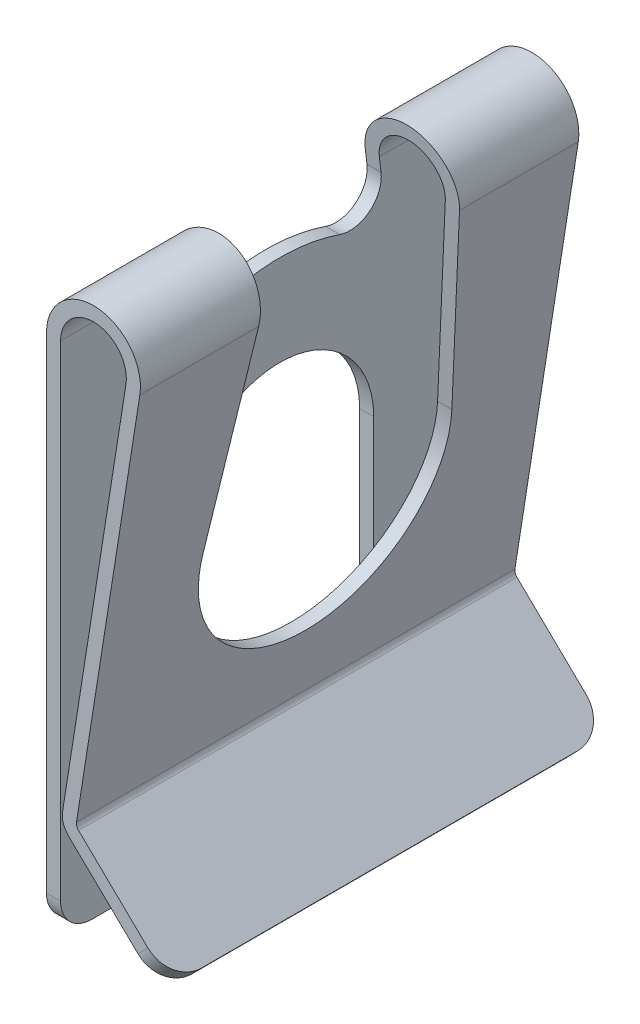
ISO-10303-21;
HEADER;
FILE_DESCRIPTION(('STEP AP214'),'2;1');
FILE_NAME('part.step','',(''),(''),'','','');
FILE_SCHEMA(('AUTOMOTIVE_DESIGN { 1 0 10303 214 1 1 1 1 }'));
ENDSEC;
DATA;
#1=APPLICATION_CONTEXT('core data for automotive mechanical design processes');
#2=APPLICATION_PROTOCOL_DEFINITION('international standard','automotive_design',2000,#1);
#3=PRODUCT_CONTEXT('',#1,'mechanical');
#4=PRODUCT('Part','Part','',(#3));
#5=PRODUCT_RELATED_PRODUCT_CATEGORY('part','',(#4));
#6=PRODUCT_DEFINITION_FORMATION('','',#4);
#7=PRODUCT_DEFINITION_CONTEXT('part definition',#1,'design');
#8=PRODUCT_DEFINITION('design','',#6,#7);
#9=PRODUCT_DEFINITION_SHAPE('','',#8);
#10=(LENGTH_UNIT() NAMED_UNIT(*) SI_UNIT(.MILLI.,.METRE.));
#11=(NAMED_UNIT(*) PLANE_ANGLE_UNIT() SI_UNIT($,.RADIAN.));
#12=(NAMED_UNIT(*) SI_UNIT($,.STERADIAN.) SOLID_ANGLE_UNIT());
#13=UNCERTAINTY_MEASURE_WITH_UNIT(LENGTH_MEASURE(1.E-05),#10,'distance_accuracy_value','');
#14=(GEOMETRIC_REPRESENTATION_CONTEXT(3) GLOBAL_UNCERTAINTY_ASSIGNED_CONTEXT((#13)) GLOBAL_UNIT_ASSIGNED_CONTEXT((#10,
#11,#12)) REPRESENTATION_CONTEXT('',''));
#15=CARTESIAN_POINT('',(0.,0.,0.));
#16=DIRECTION('',(0.,0.,1.));
#17=DIRECTION('',(1.,0.,0.));
#18=AXIS2_PLACEMENT_3D('',#15,#16,#17);
#19=CARTESIAN_POINT('',(0.711367038189841,-6.47841689545899,7.));
#20=DIRECTION('',(0.695317235453957,0.718702958168858,0.));
#21=DIRECTION('',(-0.718702958168858,0.695317235453957,0.));
#22=AXIS2_PLACEMENT_3D('',#19,#20,#21);
#23=PLANE('',#22);
#24=CARTESIAN_POINT('',(2.92425344639169,-8.61929866342166,5.99999999999992));
#25=DIRECTION('',(0.695317235453957,0.718702958168858,0.));
#26=DIRECTION('',(-0.718702958168858,0.695317235453957,0.));
#27=AXIS2_PLACEMENT_3D('',#24,#25,#26);
#28=CIRCLE('',#27,1.00000000000008);
#29=CARTESIAN_POINT('',(2.92425344639175,-8.61929866342172,7.));
#30=VERTEX_POINT('',#29);
#31=CARTESIAN_POINT('',(3.64295640456061,-9.31461589887568,6.));
#32=VERTEX_POINT('',#31);
#33=EDGE_CURVE('E405',#30,#32,#28,.T.);
#34=ORIENTED_EDGE('',*,*,#33,.F.);
#35=DIRECTION('',(0.718702958168858,-0.695317235453957,0.));
#36=VECTOR('',#35,1.);
#37=CARTESIAN_POINT('',(0.711367038189841,-6.47841689545899,7.));
#38=LINE('',#37,#36);
#39=CARTESIAN_POINT('',(0.711367038189841,-6.47841689545899,7.));
#40=VERTEX_POINT('',#39);
#41=EDGE_CURVE('E288',#40,#30,#38,.T.);
#42=ORIENTED_EDGE('',*,*,#41,.F.);
#43=DIRECTION('',(0.,0.,-1.));
#44=VECTOR('',#43,1.);
#45=CARTESIAN_POINT('',(0.711367038189841,-6.47841689545899,7.));
#46=LINE('',#45,#44);
#47=CARTESIAN_POINT('',(0.711367038189841,-6.47841689545899,-7.));
#48=VERTEX_POINT('',#47);
#49=EDGE_CURVE('E305',#40,#48,#46,.T.);
#50=ORIENTED_EDGE('',*,*,#49,.T.);
#51=DIRECTION('',(0.718702958168858,-0.695317235453957,0.));
#52=VECTOR('',#51,1.);
#53=CARTESIAN_POINT('',(0.711367038189841,-6.47841689545899,-7.));
#54=LINE('',#53,#52);
#55=CARTESIAN_POINT('',(2.92425344639175,-8.61929866342172,-7.));
#56=VERTEX_POINT('',#55);
#57=EDGE_CURVE('E264',#48,#56,#54,.T.);
#58=ORIENTED_EDGE('',*,*,#57,.T.);
#59=CARTESIAN_POINT('',(2.92425344639175,-8.61929866342172,-6.));
#60=DIRECTION('',(0.695317235453957,0.718702958168858,0.));
#61=DIRECTION('',(-0.718702958168858,0.695317235453957,0.));
#62=AXIS2_PLACEMENT_3D('',#59,#60,#61);
#63=CIRCLE('',#62,0.999999999999999);
#64=CARTESIAN_POINT('',(3.64295640456061,-9.31461589887568,-6.));
#65=VERTEX_POINT('',#64);
#66=EDGE_CURVE('E48',#65,#56,#63,.T.);
#67=ORIENTED_EDGE('',*,*,#66,.F.);
#68=DIRECTION('',(0.,0.,-1.));
#69=VECTOR('',#68,1.);
#70=CARTESIAN_POINT('',(3.64295640456061,-9.31461589887568,7.));
#71=LINE('',#70,#69);
#72=EDGE_CURVE('E406',#32,#65,#71,.T.);
#73=ORIENTED_EDGE('',*,*,#72,.F.);
#74=EDGE_LOOP('',(#34,#42,#50,#58,#67,#73));
#75=FACE_BOUND('',#74,.T.);
#76=ADVANCED_FACE('F33',(#75),#23,.F.);
#77=CARTESIAN_POINT('',(3.9561848661638,-8.99152434989389,7.));
#78=DIRECTION('',(-0.695317235453958,-0.718702958168857,0.));
#79=DIRECTION('',(0.718702958168857,-0.695317235453958,0.));
#80=AXIS2_PLACEMENT_3D('',#77,#78,#79);
#81=PLANE('',#80);
#82=CARTESIAN_POINT('',(3.23714620234597,-8.29588233224568,5.99999999999992));
#83=DIRECTION('',(-0.695317235453958,-0.718702958168857,0.));
#84=DIRECTION('',(0.718702958168857,-0.695317235453958,0.));
#85=AXIS2_PLACEMENT_3D('',#82,#83,#84);
#86=CIRCLE('',#85,1.00000000000008);
#87=CARTESIAN_POINT('',(3.95584916051489,-8.9911995676997,6.));
#88=VERTEX_POINT('',#87);
#89=CARTESIAN_POINT('',(3.23714620234603,-8.29588233224574,7.));
#90=VERTEX_POINT('',#89);
#91=EDGE_CURVE('E341',#88,#90,#86,.T.);
#92=ORIENTED_EDGE('',*,*,#91,.F.);
#93=DIRECTION('',(0.,0.,1.));
#94=VECTOR('',#93,1.);
#95=CARTESIAN_POINT('',(3.95584916051489,-8.9911995676997,7.));
#96=LINE('',#95,#94);
#97=CARTESIAN_POINT('',(3.95584916051489,-8.9911995676997,-6.));
#98=VERTEX_POINT('',#97);
#99=EDGE_CURVE('E11',#98,#88,#96,.T.);
#100=ORIENTED_EDGE('',*,*,#99,.F.);
#101=CARTESIAN_POINT('',(3.23714620234603,-8.29588233224574,-6.));
#102=DIRECTION('',(-0.695317235453958,-0.718702958168857,0.));
#103=DIRECTION('',(0.718702958168857,-0.695317235453958,0.));
#104=AXIS2_PLACEMENT_3D('',#101,#102,#103);
#105=CIRCLE('',#104,0.999999999999999);
#106=CARTESIAN_POINT('',(3.23714620234603,-8.29588233224574,-7.));
#107=VERTEX_POINT('',#106);
#108=EDGE_CURVE('E242',#107,#98,#105,.T.);
#109=ORIENTED_EDGE('',*,*,#108,.F.);
#110=DIRECTION('',(-0.718702958168857,0.695317235453958,0.));
#111=VECTOR('',#110,1.);
#112=CARTESIAN_POINT('',(3.9561848661638,-8.99152434989389,-7.));
#113=LINE('',#112,#111);
#114=CARTESIAN_POINT('',(1.02425979414412,-6.155000564283,-7.));
#115=VERTEX_POINT('',#114);
#116=EDGE_CURVE('E255',#107,#115,#113,.T.);
#117=ORIENTED_EDGE('',*,*,#116,.T.);
#118=DIRECTION('',(0.,0.,-1.));
#119=VECTOR('',#118,1.);
#120=CARTESIAN_POINT('',(1.02425979414412,-6.155000564283,7.));
#121=LINE('',#120,#119);
#122=CARTESIAN_POINT('',(1.02425979414412,-6.155000564283,7.));
#123=VERTEX_POINT('',#122);
#124=EDGE_CURVE('E303',#123,#115,#121,.T.);
#125=ORIENTED_EDGE('',*,*,#124,.F.);
#126=DIRECTION('',(-0.718702958168857,0.695317235453958,0.));
#127=VECTOR('',#126,1.);
#128=CARTESIAN_POINT('',(3.9561848661638,-8.99152434989389,7.));
#129=LINE('',#128,#127);
#130=EDGE_CURVE('E291',#90,#123,#129,.T.);
#131=ORIENTED_EDGE('',*,*,#130,.F.);
#132=EDGE_LOOP('',(#92,#100,#109,#117,#125,#131));
#133=FACE_BOUND('',#132,.T.);
#134=ADVANCED_FACE('F253',(#133),#81,.F.);
#135=CARTESIAN_POINT('',(1.5,7.1,7.));
#136=DIRECTION('',(0.,0.,1.));
#137=DIRECTION('',(1.,0.,0.));
#138=AXIS2_PLACEMENT_3D('',#135,#136,#137);
#139=PLANE('',#138);
#140=ORIENTED_EDGE('',*,*,#41,.T.);
#141=DIRECTION('',(0.695317235453959,0.718702958168856,0.));
#142=VECTOR('',#141,1.);
#143=CARTESIAN_POINT('',(10.0910261993438,-1.21148462483,7.));
#144=LINE('',#143,#142);
#145=EDGE_CURVE('E41',#30,#90,#144,.T.);
#146=ORIENTED_EDGE('',*,*,#145,.T.);
#147=ORIENTED_EDGE('',*,*,#130,.T.);
#148=CARTESIAN_POINT('',(1.18070617212128,-5.993292398695,7.));
#149=DIRECTION('',(0.,0.,-1.));
#150=DIRECTION('',(-1.,0.,0.));
#151=AXIS2_PLACEMENT_3D('',#148,#149,#150);
#152=CIRCLE('',#151,0.225000000000019);
#153=CARTESIAN_POINT('',(0.958454974137107,-5.95822952667049,7.));
#154=VERTEX_POINT('',#153);
#155=EDGE_CURVE('E293',#123,#154,#152,.T.);
#156=ORIENTED_EDGE('',*,*,#155,.T.);
#157=DIRECTION('',(0.155834986775622,0.987783102151804,0.));
#158=VECTOR('',#157,1.);
#159=CARTESIAN_POINT('',(0.958454974137106,-5.95822952667049,7.));
#160=LINE('',#159,#158);
#161=CARTESIAN_POINT('',(2.98167465322771,6.86624751983657,7.));
#162=VERTEX_POINT('',#161);
#163=EDGE_CURVE('E295',#154,#162,#160,.T.);
#164=ORIENTED_EDGE('',*,*,#163,.T.);
#165=CARTESIAN_POINT('',(1.5,7.1,7.));
#166=DIRECTION('',(0.,0.,1.));
#167=DIRECTION('',(1.,0.,0.));
#168=AXIS2_PLACEMENT_3D('',#165,#166,#167);
#169=CIRCLE('',#168,1.5);
#170=CARTESIAN_POINT('',(0.,7.1,7.));
#171=VERTEX_POINT('',#170);
#172=EDGE_CURVE('E274',#162,#171,#169,.T.);
#173=ORIENTED_EDGE('',*,*,#172,.T.);
#174=DIRECTION('',(0.,-1.,0.));
#175=VECTOR('',#174,1.);
#176=CARTESIAN_POINT('',(0.,7.1,7.));
#177=LINE('',#176,#175);
#178=CARTESIAN_POINT('',(0.,-8.40000000000001,7.));
#179=VERTEX_POINT('',#178);
#180=EDGE_CURVE('E277',#171,#179,#177,.T.);
#181=ORIENTED_EDGE('',*,*,#180,.T.);
#182=DIRECTION('',(-1.,0.,0.));
#183=VECTOR('',#182,1.);
#184=CARTESIAN_POINT('',(0.45,-8.40000000000001,7.));
#185=LINE('',#184,#183);
#186=CARTESIAN_POINT('',(0.45,-8.40000000000001,7.));
#187=VERTEX_POINT('',#186);
#188=EDGE_CURVE('E368',#187,#179,#185,.T.);
#189=ORIENTED_EDGE('',*,*,#188,.F.);
#190=DIRECTION('',(0.,1.,0.));
#191=VECTOR('',#190,1.);
#192=CARTESIAN_POINT('',(0.45,-9.4,7.));
#193=LINE('',#192,#191);
#194=CARTESIAN_POINT('',(0.45,7.1,7.));
#195=VERTEX_POINT('',#194);
#196=EDGE_CURVE('E280',#187,#195,#193,.T.);
#197=ORIENTED_EDGE('',*,*,#196,.T.);
#198=CARTESIAN_POINT('',(1.5,7.1,7.));
#199=DIRECTION('',(0.,0.,-1.));
#200=DIRECTION('',(-1.,0.,0.));
#201=AXIS2_PLACEMENT_3D('',#198,#199,#200);
#202=CIRCLE('',#201,1.05);
#203=CARTESIAN_POINT('',(2.53717225725939,6.9363732638856,7.));
#204=VERTEX_POINT('',#203);
#205=EDGE_CURVE('E282',#195,#204,#202,.T.);
#206=ORIENTED_EDGE('',*,*,#205,.T.);
#207=DIRECTION('',(-0.155834986775621,-0.987783102151805,0.));
#208=VECTOR('',#207,1.);
#209=CARTESIAN_POINT('',(2.53717225725939,6.9363732638856,7.));
#210=LINE('',#209,#208);
#211=CARTESIAN_POINT('',(0.513952578168794,-5.88810378262146,7.));
#212=VERTEX_POINT('',#211);
#213=EDGE_CURVE('E284',#204,#212,#210,.T.);
#214=ORIENTED_EDGE('',*,*,#213,.T.);
#215=CARTESIAN_POINT('',(1.18070617212128,-5.993292398695,7.));
#216=DIRECTION('',(0.,0.,1.));
#217=DIRECTION('',(1.,0.,0.));
#218=AXIS2_PLACEMENT_3D('',#215,#216,#217);
#219=CIRCLE('',#218,0.675000000000019);
#220=EDGE_CURVE('E286',#212,#40,#219,.T.);
#221=ORIENTED_EDGE('',*,*,#220,.T.);
#222=EDGE_LOOP('',(#140,#146,#147,#156,#164,#173,#181,#189,#197,#206,#214,#221));
#223=FACE_BOUND('',#222,.T.);
#224=ADVANCED_FACE('F337',(#223),#139,.T.);
#225=CARTESIAN_POINT('',(0.,7.1,7.));
#226=DIRECTION('',(1.,0.,0.));
#227=DIRECTION('',(0.,0.,-1.));
#228=AXIS2_PLACEMENT_3D('',#225,#226,#227);
#229=PLANE('',#228);
#230=CARTESIAN_POINT('',(0.,-8.89999999999999,3.50000000000001));
#231=DIRECTION('',(-1.,0.,0.));
#232=DIRECTION('',(0.,0.,1.));
#233=AXIS2_PLACEMENT_3D('',#230,#231,#232);
#234=CIRCLE('',#233,0.500000000000013);
#235=CARTESIAN_POINT('',(0.,-8.9,3.));
#236=VERTEX_POINT('',#235);
#237=CARTESIAN_POINT('',(0.,-9.4,3.5));
#238=VERTEX_POINT('',#237);
#239=EDGE_CURVE('E56',#236,#238,#234,.T.);
#240=ORIENTED_EDGE('',*,*,#239,.T.);
#241=DIRECTION('',(0.,0.,-1.));
#242=VECTOR('',#241,1.);
#243=CARTESIAN_POINT('',(0.,-9.4,7.));
#244=LINE('',#243,#242);
#245=CARTESIAN_POINT('',(0.,-9.4,6.));
#246=VERTEX_POINT('',#245);
#247=EDGE_CURVE('E322',#246,#238,#244,.T.);
#248=ORIENTED_EDGE('',*,*,#247,.F.);
#249=CARTESIAN_POINT('',(0.,-8.40000000000001,6.00000000000001));
#250=DIRECTION('',(-1.,0.,0.));
#251=DIRECTION('',(0.,0.,1.));
#252=AXIS2_PLACEMENT_3D('',#249,#250,#251);
#253=CIRCLE('',#252,0.999999999999993);
#254=EDGE_CURVE('E366',#246,#179,#253,.T.);
#255=ORIENTED_EDGE('',*,*,#254,.T.);
#256=ORIENTED_EDGE('',*,*,#180,.F.);
#257=DIRECTION('',(0.,0.,-1.));
#258=VECTOR('',#257,1.);
#259=CARTESIAN_POINT('',(0.,7.1,7.));
#260=LINE('',#259,#258);
#261=CARTESIAN_POINT('',(0.,7.1,3.17939016751465));
#262=VERTEX_POINT('',#261);
#263=EDGE_CURVE('E326',#171,#262,#260,.T.);
#264=ORIENTED_EDGE('',*,*,#263,.T.);
#265=DIRECTION('',(0.,-0.992924512493335,0.11874726308372));
#266=VECTOR('',#265,1.);
#267=CARTESIAN_POINT('',(0.,6.64952309550553,3.23326425242048));
#268=LINE('',#267,#266);
#269=CARTESIAN_POINT('',(0.,6.64471868731614,3.23383882814708));
#270=VERTEX_POINT('',#269);
#271=EDGE_CURVE('E363',#262,#270,#268,.T.);
#272=ORIENTED_EDGE('',*,*,#271,.T.);
#273=CARTESIAN_POINT('',(0.,6.52597142423242,2.24091431565374));
#274=DIRECTION('',(1.,0.,0.));
#275=DIRECTION('',(0.,0.,-1.));
#276=AXIS2_PLACEMENT_3D('',#273,#274,#275);
#277=CIRCLE('',#276,1.);
#278=CARTESIAN_POINT('',(0.,5.58017846419873,1.91614412497929));
#279=VERTEX_POINT('',#278);
#280=EDGE_CURVE('E477',#270,#279,#277,.T.);
#281=ORIENTED_EDGE('',*,*,#280,.T.);
#282=CARTESIAN_POINT('',(0.,0.,0.));
#283=DIRECTION('',(1.,0.,0.));
#284=DIRECTION('',(0.,0.,-1.));
#285=AXIS2_PLACEMENT_3D('',#282,#283,#284);
#286=CIRCLE('',#285,5.90000000000003);
#287=CARTESIAN_POINT('',(0.,5.58017846419874,-1.91614412497929));
#288=VERTEX_POINT('',#287);
#289=EDGE_CURVE('E462',#279,#288,#286,.F.);
#290=ORIENTED_EDGE('',*,*,#289,.T.);
#291=CARTESIAN_POINT('',(0.,6.52597142423241,-2.24091431565375));
#292=DIRECTION('',(1.,0.,0.));
#293=DIRECTION('',(0.,0.,-1.));
#294=AXIS2_PLACEMENT_3D('',#291,#292,#293);
#295=CIRCLE('',#294,0.999999999999993);
#296=CARTESIAN_POINT('',(0.,6.64471868731614,-3.23383882814708));
#297=VERTEX_POINT('',#296);
#298=EDGE_CURVE('E470',#288,#297,#295,.T.);
#299=ORIENTED_EDGE('',*,*,#298,.T.);
#300=DIRECTION('',(0.,0.992924512493335,0.11874726308372));
#301=VECTOR('',#300,1.);
#302=CARTESIAN_POINT('',(0.,8.30022205180802,-3.03585147756224));
#303=LINE('',#302,#301);
#304=CARTESIAN_POINT('',(0.,7.1,-3.17939016751465));
#305=VERTEX_POINT('',#304);
#306=EDGE_CURVE('E473',#297,#305,#303,.T.);
#307=ORIENTED_EDGE('',*,*,#306,.T.);
#308=CARTESIAN_POINT('',(0.,7.1,-7.));
#309=VERTEX_POINT('',#308);
#310=EDGE_CURVE('E325',#305,#309,#260,.T.);
#311=ORIENTED_EDGE('',*,*,#310,.T.);
#312=DIRECTION('',(0.,-1.,0.));
#313=VECTOR('',#312,1.);
#314=CARTESIAN_POINT('',(0.,7.1,-7.));
#315=LINE('',#314,#313);
#316=CARTESIAN_POINT('',(0.,-8.4,-7.));
#317=VERTEX_POINT('',#316);
#318=EDGE_CURVE('E522',#309,#317,#315,.T.);
#319=ORIENTED_EDGE('',*,*,#318,.T.);
#320=CARTESIAN_POINT('',(0.,-8.40000000000001,-6.00000000000001));
#321=DIRECTION('',(-1.,0.,0.));
#322=DIRECTION('',(0.,0.,1.));
#323=AXIS2_PLACEMENT_3D('',#320,#321,#322);
#324=CIRCLE('',#323,0.999999999999994);
#325=CARTESIAN_POINT('',(0.,-9.4,-6.));
#326=VERTEX_POINT('',#325);
#327=EDGE_CURVE('E431',#317,#326,#324,.T.);
#328=ORIENTED_EDGE('',*,*,#327,.T.);
#329=CARTESIAN_POINT('',(0.,-9.4,-3.5));
#330=VERTEX_POINT('',#329);
#331=EDGE_CURVE('E321',#330,#326,#244,.T.);
#332=ORIENTED_EDGE('',*,*,#331,.F.);
#333=CARTESIAN_POINT('',(0.,-8.89999999999999,-3.50000000000001));
#334=DIRECTION('',(-1.,0.,0.));
#335=DIRECTION('',(0.,0.,1.));
#336=AXIS2_PLACEMENT_3D('',#333,#334,#335);
#337=CIRCLE('',#336,0.500000000000013);
#338=CARTESIAN_POINT('',(0.,-8.89999999999999,-3.));
#339=VERTEX_POINT('',#338);
#340=EDGE_CURVE('E421',#330,#339,#337,.T.);
#341=ORIENTED_EDGE('',*,*,#340,.T.);
#342=DIRECTION('',(0.,1.,0.));
#343=VECTOR('',#342,1.);
#344=CARTESIAN_POINT('',(0.,-9.4,-3.));
#345=LINE('',#344,#343);
#346=CARTESIAN_POINT('',(0.,0.,-3.));
#347=VERTEX_POINT('',#346);
#348=EDGE_CURVE('E502',#339,#347,#345,.T.);
#349=ORIENTED_EDGE('',*,*,#348,.T.);
#350=CARTESIAN_POINT('',(0.,0.,0.));
#351=DIRECTION('',(1.,0.,0.));
#352=DIRECTION('',(0.,0.,-1.));
#353=AXIS2_PLACEMENT_3D('',#350,#351,#352);
#354=CIRCLE('',#353,3.);
#355=CARTESIAN_POINT('',(0.,0.,3.));
#356=VERTEX_POINT('',#355);
#357=EDGE_CURVE('E498',#347,#356,#354,.T.);
#358=ORIENTED_EDGE('',*,*,#357,.T.);
#359=DIRECTION('',(0.,-1.,0.));
#360=VECTOR('',#359,1.);
#361=CARTESIAN_POINT('',(0.,0.,3.));
#362=LINE('',#361,#360);
#363=EDGE_CURVE('E510',#356,#236,#362,.T.);
#364=ORIENTED_EDGE('',*,*,#363,.T.);
#365=EDGE_LOOP('',(#240,#248,#255,#256,#264,#272,#281,#290,#299,#307,#311,#319,#328,#332,#341,
#349,#358,#364));
#366=FACE_BOUND('',#365,.T.);
#367=ADVANCED_FACE('F361',(#366),#229,.F.);
#368=CARTESIAN_POINT('',(0.45,-9.4,7.));
#369=DIRECTION('',(-1.,0.,0.));
#370=DIRECTION('',(0.,0.,1.));
#371=AXIS2_PLACEMENT_3D('',#368,#369,#370);
#372=PLANE('',#371);
#373=CARTESIAN_POINT('',(0.45,-8.89999999999999,3.50000000000001));
#374=DIRECTION('',(-1.,0.,0.));
#375=DIRECTION('',(0.,0.,1.));
#376=AXIS2_PLACEMENT_3D('',#373,#374,#375);
#377=CIRCLE('',#376,0.500000000000013);
#378=CARTESIAN_POINT('',(0.45,-8.9,3.));
#379=VERTEX_POINT('',#378);
#380=CARTESIAN_POINT('',(0.45,-9.4,3.5));
#381=VERTEX_POINT('',#380);
#382=EDGE_CURVE('E414',#379,#381,#377,.T.);
#383=ORIENTED_EDGE('',*,*,#382,.F.);
#384=DIRECTION('',(0.,-1.,0.));
#385=VECTOR('',#384,1.);
#386=CARTESIAN_POINT('',(0.45,0.,3.));
#387=LINE('',#386,#385);
#388=CARTESIAN_POINT('',(0.45,0.,3.));
#389=VERTEX_POINT('',#388);
#390=EDGE_CURVE('E501',#389,#379,#387,.T.);
#391=ORIENTED_EDGE('',*,*,#390,.F.);
#392=CARTESIAN_POINT('',(0.45,0.,0.));
#393=DIRECTION('',(1.,0.,0.));
#394=DIRECTION('',(0.,0.,-1.));
#395=AXIS2_PLACEMENT_3D('',#392,#393,#394);
#396=CIRCLE('',#395,3.);
#397=CARTESIAN_POINT('',(0.45,0.,-3.));
#398=VERTEX_POINT('',#397);
#399=EDGE_CURVE('E499',#398,#389,#396,.T.);
#400=ORIENTED_EDGE('',*,*,#399,.F.);
#401=DIRECTION('',(0.,1.,0.));
#402=VECTOR('',#401,1.);
#403=CARTESIAN_POINT('',(0.45,-9.4,-3.));
#404=LINE('',#403,#402);
#405=CARTESIAN_POINT('',(0.45,-8.89999999999999,-3.));
#406=VERTEX_POINT('',#405);
#407=EDGE_CURVE('E505',#406,#398,#404,.T.);
#408=ORIENTED_EDGE('',*,*,#407,.F.);
#409=CARTESIAN_POINT('',(0.45,-8.89999999999999,-3.50000000000001));
#410=DIRECTION('',(-1.,0.,0.));
#411=DIRECTION('',(0.,0.,1.));
#412=AXIS2_PLACEMENT_3D('',#409,#410,#411);
#413=CIRCLE('',#412,0.500000000000013);
#414=CARTESIAN_POINT('',(0.45,-9.4,-3.5));
#415=VERTEX_POINT('',#414);
#416=EDGE_CURVE('E422',#415,#406,#413,.T.);
#417=ORIENTED_EDGE('',*,*,#416,.F.);
#418=DIRECTION('',(0.,0.,-1.));
#419=VECTOR('',#418,1.);
#420=CARTESIAN_POINT('',(0.45,-9.4,7.));
#421=LINE('',#420,#419);
#422=CARTESIAN_POINT('',(0.45,-9.4,-6.));
#423=VERTEX_POINT('',#422);
#424=EDGE_CURVE('E317',#415,#423,#421,.T.);
#425=ORIENTED_EDGE('',*,*,#424,.T.);
#426=CARTESIAN_POINT('',(0.45,-8.40000000000001,-6.00000000000001));
#427=DIRECTION('',(-1.,0.,0.));
#428=DIRECTION('',(0.,0.,1.));
#429=AXIS2_PLACEMENT_3D('',#426,#427,#428);
#430=CIRCLE('',#429,0.999999999999994);
#431=CARTESIAN_POINT('',(0.45,-8.4,-7.));
#432=VERTEX_POINT('',#431);
#433=EDGE_CURVE('E432',#432,#423,#430,.T.);
#434=ORIENTED_EDGE('',*,*,#433,.F.);
#435=DIRECTION('',(0.,1.,0.));
#436=VECTOR('',#435,1.);
#437=CARTESIAN_POINT('',(0.45,-9.4,-7.));
#438=LINE('',#437,#436);
#439=CARTESIAN_POINT('',(0.45,7.1,-7.));
#440=VERTEX_POINT('',#439);
#441=EDGE_CURVE('E525',#432,#440,#438,.T.);
#442=ORIENTED_EDGE('',*,*,#441,.T.);
#443=DIRECTION('',(0.,0.,-1.));
#444=VECTOR('',#443,1.);
#445=CARTESIAN_POINT('',(0.45,7.1,7.));
#446=LINE('',#445,#444);
#447=CARTESIAN_POINT('',(0.45,7.1,-3.17939016751465));
#448=VERTEX_POINT('',#447);
#449=EDGE_CURVE('E313',#448,#440,#446,.T.);
#450=ORIENTED_EDGE('',*,*,#449,.F.);
#451=DIRECTION('',(0.,0.992924512493334,0.11874726308372));
#452=VECTOR('',#451,1.);
#453=CARTESIAN_POINT('',(0.45,6.64471868731614,-3.23383882814708));
#454=LINE('',#453,#452);
#455=CARTESIAN_POINT('',(0.45,6.64471868731614,-3.23383882814708));
#456=VERTEX_POINT('',#455);
#457=EDGE_CURVE('E456',#456,#448,#454,.T.);
#458=ORIENTED_EDGE('',*,*,#457,.F.);
#459=CARTESIAN_POINT('',(0.45,6.52597142423241,-2.24091431565375));
#460=DIRECTION('',(1.,0.,0.));
#461=DIRECTION('',(0.,0.,-1.));
#462=AXIS2_PLACEMENT_3D('',#459,#460,#461);
#463=CIRCLE('',#462,0.999999999999993);
#464=CARTESIAN_POINT('',(0.45,5.58017846419874,-1.91614412497929));
#465=VERTEX_POINT('',#464);
#466=EDGE_CURVE('E453',#465,#456,#463,.T.);
#467=ORIENTED_EDGE('',*,*,#466,.F.);
#468=CARTESIAN_POINT('',(0.45,0.,0.));
#469=DIRECTION('',(-1.,0.,0.));
#470=DIRECTION('',(0.,0.,1.));
#471=AXIS2_PLACEMENT_3D('',#468,#469,#470);
#472=CIRCLE('',#471,5.90000000000003);
#473=CARTESIAN_POINT('',(0.45,5.58017846419873,1.91614412497929));
#474=VERTEX_POINT('',#473);
#475=EDGE_CURVE('E450',#474,#465,#472,.T.);
#476=ORIENTED_EDGE('',*,*,#475,.F.);
#477=CARTESIAN_POINT('',(0.45,6.52597142423242,2.24091431565374));
#478=DIRECTION('',(1.,0.,0.));
#479=DIRECTION('',(0.,0.,-1.));
#480=AXIS2_PLACEMENT_3D('',#477,#478,#479);
#481=CIRCLE('',#480,1.);
#482=CARTESIAN_POINT('',(0.45,6.64471868731614,3.23383882814708));
#483=VERTEX_POINT('',#482);
#484=EDGE_CURVE('E447',#483,#474,#481,.T.);
#485=ORIENTED_EDGE('',*,*,#484,.F.);
#486=DIRECTION('',(0.,-0.992924512493334,0.11874726308372));
#487=VECTOR('',#486,1.);
#488=CARTESIAN_POINT('',(0.45,8.6,3.));
#489=LINE('',#488,#487);
#490=CARTESIAN_POINT('',(0.45,7.1,3.17939016751465));
#491=VERTEX_POINT('',#490);
#492=EDGE_CURVE('E383',#491,#483,#489,.T.);
#493=ORIENTED_EDGE('',*,*,#492,.F.);
#494=EDGE_CURVE('E314',#195,#491,#446,.T.);
#495=ORIENTED_EDGE('',*,*,#494,.F.);
#496=ORIENTED_EDGE('',*,*,#196,.F.);
#497=CARTESIAN_POINT('',(0.45,-8.40000000000001,6.00000000000001));
#498=DIRECTION('',(-1.,0.,0.));
#499=DIRECTION('',(0.,0.,1.));
#500=AXIS2_PLACEMENT_3D('',#497,#498,#499);
#501=CIRCLE('',#500,0.999999999999993);
#502=CARTESIAN_POINT('',(0.45,-9.4,6.));
#503=VERTEX_POINT('',#502);
#504=EDGE_CURVE('E373',#503,#187,#501,.T.);
#505=ORIENTED_EDGE('',*,*,#504,.F.);
#506=EDGE_CURVE('E318',#503,#381,#421,.T.);
#507=ORIENTED_EDGE('',*,*,#506,.T.);
#508=EDGE_LOOP('',(#383,#391,#400,#408,#417,#425,#434,#442,#450,#458,#467,#476,#485,#493,#495,
#496,#505,#507));
#509=FACE_BOUND('',#508,.T.);
#510=ADVANCED_FACE('F378',(#509),#372,.F.);
#511=CARTESIAN_POINT('',(0.,-9.4,7.));
#512=DIRECTION('',(0.,1.,0.));
#513=DIRECTION('',(0.,0.,1.));
#514=AXIS2_PLACEMENT_3D('',#511,#512,#513);
#515=PLANE('',#514);
#516=DIRECTION('',(-1.,0.,0.));
#517=VECTOR('',#516,1.);
#518=CARTESIAN_POINT('',(0.45,-9.4,3.5));
#519=LINE('',#518,#517);
#520=EDGE_CURVE('E419',#381,#238,#519,.T.);
#521=ORIENTED_EDGE('',*,*,#520,.F.);
#522=ORIENTED_EDGE('',*,*,#506,.F.);
#523=DIRECTION('',(-1.,0.,0.));
#524=VECTOR('',#523,1.);
#525=CARTESIAN_POINT('',(0.45,-9.4,6.));
#526=LINE('',#525,#524);
#527=EDGE_CURVE('E372',#503,#246,#526,.T.);
#528=ORIENTED_EDGE('',*,*,#527,.T.);
#529=ORIENTED_EDGE('',*,*,#247,.T.);
#530=EDGE_LOOP('',(#521,#522,#528,#529));
#531=FACE_BOUND('',#530,.T.);
#532=ADVANCED_FACE('F570',(#531),#515,.F.);
#533=CARTESIAN_POINT('',(0.45,0.,3.));
#534=DIRECTION('',(0.,0.,-1.));
#535=DIRECTION('',(-1.,0.,0.));
#536=AXIS2_PLACEMENT_3D('',#533,#534,#535);
#537=PLANE('',#536);
#538=ORIENTED_EDGE('',*,*,#390,.T.);
#539=DIRECTION('',(-1.,0.,0.));
#540=VECTOR('',#539,1.);
#541=CARTESIAN_POINT('',(0.45,-8.9,3.));
#542=LINE('',#541,#540);
#543=EDGE_CURVE('E416',#379,#236,#542,.T.);
#544=ORIENTED_EDGE('',*,*,#543,.T.);
#545=ORIENTED_EDGE('',*,*,#363,.F.);
#546=DIRECTION('',(-1.,0.,0.));
#547=VECTOR('',#546,1.);
#548=CARTESIAN_POINT('',(0.45,0.,3.));
#549=LINE('',#548,#547);
#550=EDGE_CURVE('E516',#389,#356,#549,.T.);
#551=ORIENTED_EDGE('',*,*,#550,.F.);
#552=EDGE_LOOP('',(#538,#544,#545,#551));
#553=FACE_BOUND('',#552,.T.);
#554=ADVANCED_FACE('F572',(#553),#537,.T.);
#555=ORIENTED_EDGE('',*,*,#424,.F.);
#556=DIRECTION('',(-1.,0.,0.));
#557=VECTOR('',#556,1.);
#558=CARTESIAN_POINT('',(0.45,-9.4,-3.5));
#559=LINE('',#558,#557);
#560=EDGE_CURVE('E428',#415,#330,#559,.T.);
#561=ORIENTED_EDGE('',*,*,#560,.T.);
#562=ORIENTED_EDGE('',*,*,#331,.T.);
#563=DIRECTION('',(-1.,0.,0.));
#564=VECTOR('',#563,1.);
#565=CARTESIAN_POINT('',(0.45,-9.4,-6.));
#566=LINE('',#565,#564);
#567=EDGE_CURVE('E440',#423,#326,#566,.T.);
#568=ORIENTED_EDGE('',*,*,#567,.F.);
#569=EDGE_LOOP('',(#555,#561,#562,#568));
#570=FACE_BOUND('',#569,.T.);
#571=ADVANCED_FACE('F574',(#570),#515,.F.);
#572=CARTESIAN_POINT('',(1.5,7.1,7.));
#573=DIRECTION('',(0.,0.,-1.));
#574=DIRECTION('',(-1.,0.,0.));
#575=AXIS2_PLACEMENT_3D('',#572,#573,#574);
#576=CYLINDRICAL_SURFACE('',#575,1.5);
#577=CARTESIAN_POINT('',(1.5,7.1,3.17939016751465));
#578=DIRECTION('',(0.,-0.118747263083721,-0.992924512493334));
#579=DIRECTION('',(0.,0.992924512493334,-0.118747263083721));
#580=AXIS2_PLACEMENT_3D('',#577,#578,#579);
#581=ELLIPSE('',#580,1.5106888601565,1.5);
#582=CARTESIAN_POINT('',(2.98167465322771,6.86624751983657,3.20734543189697));
#583=VERTEX_POINT('',#582);
#584=EDGE_CURVE('E357',#262,#583,#581,.T.);
#585=ORIENTED_EDGE('',*,*,#584,.F.);
#586=ORIENTED_EDGE('',*,*,#263,.F.);
#587=ORIENTED_EDGE('',*,*,#172,.F.);
#588=DIRECTION('',(0.,0.,-1.));
#589=VECTOR('',#588,1.);
#590=CARTESIAN_POINT('',(2.98167465322771,6.86624751983657,7.));
#591=LINE('',#590,#589);
#592=EDGE_CURVE('E298',#162,#583,#591,.T.);
#593=ORIENTED_EDGE('',*,*,#592,.T.);
#594=EDGE_LOOP('',(#585,#586,#587,#593));
#595=FACE_BOUND('',#594,.T.);
#596=ADVANCED_FACE('F356',(#595),#576,.T.);
#597=ORIENTED_EDGE('',*,*,#310,.F.);
#598=CARTESIAN_POINT('',(1.5,7.1,-3.17939016751465));
#599=DIRECTION('',(0.,-0.118747263083721,0.992924512493334));
#600=DIRECTION('',(0.,-0.992924512493334,-0.118747263083721));
#601=AXIS2_PLACEMENT_3D('',#598,#599,#600);
#602=ELLIPSE('',#601,1.5106888601565,1.5);
#603=CARTESIAN_POINT('',(2.98167465322771,6.86624751983657,-3.20734543189697));
#604=VERTEX_POINT('',#603);
#605=EDGE_CURVE('E489',#604,#305,#602,.T.);
#606=ORIENTED_EDGE('',*,*,#605,.F.);
#607=CARTESIAN_POINT('',(2.98167465322771,6.86624751983657,-7.));
#608=VERTEX_POINT('',#607);
#609=EDGE_CURVE('E297',#604,#608,#591,.T.);
#610=ORIENTED_EDGE('',*,*,#609,.T.);
#611=CARTESIAN_POINT('',(1.5,7.1,-7.));
#612=DIRECTION('',(0.,0.,1.));
#613=DIRECTION('',(1.,0.,0.));
#614=AXIS2_PLACEMENT_3D('',#611,#612,#613);
#615=CIRCLE('',#614,1.5);
#616=EDGE_CURVE('E519',#608,#309,#615,.T.);
#617=ORIENTED_EDGE('',*,*,#616,.T.);
#618=EDGE_LOOP('',(#597,#606,#610,#617));
#619=FACE_BOUND('',#618,.T.);
#620=ADVANCED_FACE('F35',(#619),#576,.T.);
#621=CARTESIAN_POINT('',(1.5,7.1,7.));
#622=DIRECTION('',(0.,0.,-1.));
#623=DIRECTION('',(-1.,0.,0.));
#624=AXIS2_PLACEMENT_3D('',#621,#622,#623);
#625=CYLINDRICAL_SURFACE('',#624,1.05);
#626=CARTESIAN_POINT('',(1.5,7.1,-3.17939016751465));
#627=DIRECTION('',(0.,-0.118747263083721,0.992924512493334));
#628=DIRECTION('',(0.,-0.992924512493334,-0.118747263083721));
#629=AXIS2_PLACEMENT_3D('',#626,#627,#628);
#630=ELLIPSE('',#629,1.05748220210954,1.05);
#631=CARTESIAN_POINT('',(2.53717225725939,6.9363732638856,-3.19895885258228));
#632=VERTEX_POINT('',#631);
#633=EDGE_CURVE('E493',#448,#632,#630,.F.);
#634=ORIENTED_EDGE('',*,*,#633,.F.);
#635=ORIENTED_EDGE('',*,*,#449,.T.);
#636=CARTESIAN_POINT('',(1.5,7.1,-7.));
#637=DIRECTION('',(0.,0.,-1.));
#638=DIRECTION('',(-1.,0.,0.));
#639=AXIS2_PLACEMENT_3D('',#636,#637,#638);
#640=CIRCLE('',#639,1.05);
#641=CARTESIAN_POINT('',(2.53717225725939,6.9363732638856,-7.));
#642=VERTEX_POINT('',#641);
#643=EDGE_CURVE('E527',#440,#642,#640,.T.);
#644=ORIENTED_EDGE('',*,*,#643,.T.);
#645=DIRECTION('',(0.,0.,-1.));
#646=VECTOR('',#645,1.);
#647=CARTESIAN_POINT('',(2.53717225725939,6.9363732638856,7.));
#648=LINE('',#647,#646);
#649=EDGE_CURVE('E309',#632,#642,#648,.T.);
#650=ORIENTED_EDGE('',*,*,#649,.F.);
#651=EDGE_LOOP('',(#634,#635,#644,#650));
#652=FACE_BOUND('',#651,.T.);
#653=ADVANCED_FACE('F535',(#652),#625,.F.);
#654=CARTESIAN_POINT('',(1.5,7.1,3.17939016751465));
#655=DIRECTION('',(0.,-0.118747263083721,-0.992924512493334));
#656=DIRECTION('',(0.,0.992924512493334,-0.118747263083721));
#657=AXIS2_PLACEMENT_3D('',#654,#655,#656);
#658=ELLIPSE('',#657,1.05748220210954,1.05);
#659=CARTESIAN_POINT('',(2.53717225725939,6.9363732638856,3.19895885258228));
#660=VERTEX_POINT('',#659);
#661=EDGE_CURVE('E487',#660,#491,#658,.F.);
#662=ORIENTED_EDGE('',*,*,#661,.F.);
#663=EDGE_CURVE('E310',#204,#660,#648,.T.);
#664=ORIENTED_EDGE('',*,*,#663,.F.);
#665=ORIENTED_EDGE('',*,*,#205,.F.);
#666=ORIENTED_EDGE('',*,*,#494,.T.);
#667=EDGE_LOOP('',(#662,#664,#665,#666));
#668=FACE_BOUND('',#667,.T.);
#669=ADVANCED_FACE('F388',(#668),#625,.F.);
#670=CARTESIAN_POINT('',(2.53717225725939,6.9363732638856,7.));
#671=DIRECTION('',(0.987783102151804,-0.155834986775621,0.));
#672=DIRECTION('',(0.155834986775621,0.987783102151805,0.));
#673=AXIS2_PLACEMENT_3D('',#670,#671,#672);
#674=PLANE('',#673);
#675=DIRECTION('',(-0.154758877909981,-0.980962027016184,-0.117316628234629));
#676=VECTOR('',#675,1.);
#677=CARTESIAN_POINT('',(2.72234240981267,8.11010165119802,-3.05858863123783));
#678=LINE('',#677,#676);
#679=CARTESIAN_POINT('',(1.51780907827228,0.474989052334883,-3.97169804997334));
#680=VERTEX_POINT('',#679);
#681=EDGE_CURVE('E491',#632,#680,#678,.T.);
#682=ORIENTED_EDGE('',*,*,#681,.F.);
#683=ORIENTED_EDGE('',*,*,#649,.T.);
#684=DIRECTION('',(-0.155834986775621,-0.987783102151805,0.));
#685=VECTOR('',#684,1.);
#686=CARTESIAN_POINT('',(2.53717225725939,6.9363732638856,-7.));
#687=LINE('',#686,#685);
#688=CARTESIAN_POINT('',(0.513952578168794,-5.88810378262146,-7.));
#689=VERTEX_POINT('',#688);
#690=EDGE_CURVE('E398',#642,#689,#687,.T.);
#691=ORIENTED_EDGE('',*,*,#690,.T.);
#692=DIRECTION('',(0.,0.,-1.));
#693=VECTOR('',#692,1.);
#694=CARTESIAN_POINT('',(0.513952578168794,-5.88810378262146,7.));
#695=LINE('',#694,#693);
#696=EDGE_CURVE('E307',#212,#689,#695,.T.);
#697=ORIENTED_EDGE('',*,*,#696,.F.);
#698=ORIENTED_EDGE('',*,*,#213,.F.);
#699=ORIENTED_EDGE('',*,*,#663,.T.);
#700=DIRECTION('',(0.154758877909981,0.980962027016184,-0.117316628234629));
#701=VECTOR('',#700,1.);
#702=CARTESIAN_POINT('',(2.46816135337184,6.49893744709758,3.25127330888262));
#703=LINE('',#702,#701);
#704=CARTESIAN_POINT('',(1.51780907827228,0.474989052334882,3.97169804997334));
#705=VERTEX_POINT('',#704);
#706=EDGE_CURVE('E485',#705,#660,#703,.T.);
#707=ORIENTED_EDGE('',*,*,#706,.F.);
#708=CARTESIAN_POINT('',(1.44287368756968,0.,0.));
#709=DIRECTION('',(0.987783102151804,-0.155834986775621,0.));
#710=DIRECTION('',(-0.155834986775621,-0.987783102151805,0.));
#711=AXIS2_PLACEMENT_3D('',#708,#709,#710);
#712=ELLIPSE('',#711,4.04947198558705,4.);
#713=EDGE_CURVE('E495',#680,#705,#712,.F.);
#714=ORIENTED_EDGE('',*,*,#713,.F.);
#715=EDGE_LOOP('',(#682,#683,#691,#697,#698,#699,#707,#714));
#716=FACE_BOUND('',#715,.T.);
#717=ADVANCED_FACE('F396',(#716),#674,.F.);
#718=CARTESIAN_POINT('',(0.958454974137106,-5.95822952667049,7.));
#719=DIRECTION('',(-0.987783102151804,0.155834986775622,0.));
#720=DIRECTION('',(-0.155834986775622,-0.987783102151804,0.));
#721=AXIS2_PLACEMENT_3D('',#718,#719,#720);
#722=PLANE('',#721);
#723=DIRECTION('',(0.154758877909982,0.980962027016184,0.117316628234629));
#724=VECTOR('',#723,1.);
#725=CARTESIAN_POINT('',(1.17162335106612,-4.6070302549255,-4.57947424653476));
#726=LINE('',#725,#724);
#727=CARTESIAN_POINT('',(1.97337467665082,0.474989052334883,-3.97169804997334));
#728=VERTEX_POINT('',#727);
#729=EDGE_CURVE('E248',#728,#604,#726,.T.);
#730=ORIENTED_EDGE('',*,*,#729,.F.);
#731=CARTESIAN_POINT('',(1.89843928594823,0.,0.));
#732=DIRECTION('',(-0.987783102151804,0.155834986775622,0.));
#733=DIRECTION('',(-0.155834986775622,-0.987783102151804,0.));
#734=AXIS2_PLACEMENT_3D('',#731,#732,#733);
#735=ELLIPSE('',#734,4.04947198558705,4.);
#736=CARTESIAN_POINT('',(1.97337467665082,0.474989052334882,3.97169804997334));
#737=VERTEX_POINT('',#736);
#738=EDGE_CURVE('E331',#737,#728,#735,.F.);
#739=ORIENTED_EDGE('',*,*,#738,.F.);
#740=DIRECTION('',(-0.154758877909982,-0.980962027016184,0.117316628234629));
#741=VECTOR('',#740,1.);
#742=CARTESIAN_POINT('',(0.917442294625291,-6.21819445902595,4.77215892417955));
#743=LINE('',#742,#741);
#744=EDGE_CURVE('E329',#583,#737,#743,.T.);
#745=ORIENTED_EDGE('',*,*,#744,.F.);
#746=ORIENTED_EDGE('',*,*,#592,.F.);
#747=ORIENTED_EDGE('',*,*,#163,.F.);
#748=DIRECTION('',(0.,0.,-1.));
#749=VECTOR('',#748,1.);
#750=CARTESIAN_POINT('',(0.958454974137107,-5.95822952667049,7.));
#751=LINE('',#750,#749);
#752=CARTESIAN_POINT('',(0.958454974137107,-5.95822952667049,-7.));
#753=VERTEX_POINT('',#752);
#754=EDGE_CURVE('E301',#154,#753,#751,.T.);
#755=ORIENTED_EDGE('',*,*,#754,.T.);
#756=DIRECTION('',(0.155834986775622,0.987783102151804,0.));
#757=VECTOR('',#756,1.);
#758=CARTESIAN_POINT('',(0.958454974137106,-5.95822952667049,-7.));
#759=LINE('',#758,#757);
#760=EDGE_CURVE('E266',#753,#608,#759,.T.);
#761=ORIENTED_EDGE('',*,*,#760,.T.);
#762=ORIENTED_EDGE('',*,*,#609,.F.);
#763=EDGE_LOOP('',(#730,#739,#745,#746,#747,#755,#761,#762));
#764=FACE_BOUND('',#763,.T.);
#765=ADVANCED_FACE('F353',(#764),#722,.F.);
#766=CARTESIAN_POINT('',(1.18070617212128,-5.993292398695,7.));
#767=DIRECTION('',(0.,0.,-1.));
#768=DIRECTION('',(-1.,0.,0.));
#769=AXIS2_PLACEMENT_3D('',#766,#767,#768);
#770=CYLINDRICAL_SURFACE('',#769,0.675000000000019);
#771=ORIENTED_EDGE('',*,*,#696,.T.);
#772=CARTESIAN_POINT('',(1.18070617212128,-5.993292398695,-7.));
#773=DIRECTION('',(0.,0.,1.));
#774=DIRECTION('',(1.,0.,0.));
#775=AXIS2_PLACEMENT_3D('',#772,#773,#774);
#776=CIRCLE('',#775,0.675000000000019);
#777=EDGE_CURVE('E268',#689,#48,#776,.T.);
#778=ORIENTED_EDGE('',*,*,#777,.T.);
#779=ORIENTED_EDGE('',*,*,#49,.F.);
#780=ORIENTED_EDGE('',*,*,#220,.F.);
#781=EDGE_LOOP('',(#771,#778,#779,#780));
#782=FACE_BOUND('',#781,.T.);
#783=ADVANCED_FACE('F402',(#782),#770,.T.);
#784=CARTESIAN_POINT('',(1.18070617212128,-5.993292398695,7.));
#785=DIRECTION('',(0.,0.,-1.));
#786=DIRECTION('',(-1.,0.,0.));
#787=AXIS2_PLACEMENT_3D('',#784,#785,#786);
#788=CYLINDRICAL_SURFACE('',#787,0.225000000000019);
#789=ORIENTED_EDGE('',*,*,#124,.T.);
#790=CARTESIAN_POINT('',(1.18070617212128,-5.993292398695,-7.));
#791=DIRECTION('',(0.,0.,-1.));
#792=DIRECTION('',(-1.,0.,0.));
#793=AXIS2_PLACEMENT_3D('',#790,#791,#792);
#794=CIRCLE('',#793,0.225000000000019);
#795=EDGE_CURVE('E263',#115,#753,#794,.T.);
#796=ORIENTED_EDGE('',*,*,#795,.T.);
#797=ORIENTED_EDGE('',*,*,#754,.F.);
#798=ORIENTED_EDGE('',*,*,#155,.F.);
#799=EDGE_LOOP('',(#789,#796,#797,#798));
#800=FACE_BOUND('',#799,.T.);
#801=ADVANCED_FACE('F345',(#800),#788,.F.);
#802=CARTESIAN_POINT('',(1.5,7.1,-7.));
#803=DIRECTION('',(0.,0.,1.));
#804=DIRECTION('',(1.,0.,0.));
#805=AXIS2_PLACEMENT_3D('',#802,#803,#804);
#806=PLANE('',#805);
#807=ORIENTED_EDGE('',*,*,#116,.F.);
#808=DIRECTION('',(-0.695317235453959,-0.718702958168856,0.));
#809=VECTOR('',#808,1.);
#810=CARTESIAN_POINT('',(3.86293171425459,-7.64904966989377,-7.));
#811=LINE('',#810,#809);
#812=EDGE_CURVE('E239',#107,#56,#811,.T.);
#813=ORIENTED_EDGE('',*,*,#812,.T.);
#814=ORIENTED_EDGE('',*,*,#57,.F.);
#815=ORIENTED_EDGE('',*,*,#777,.F.);
#816=ORIENTED_EDGE('',*,*,#690,.F.);
#817=ORIENTED_EDGE('',*,*,#643,.F.);
#818=ORIENTED_EDGE('',*,*,#441,.F.);
#819=DIRECTION('',(-1.,0.,0.));
#820=VECTOR('',#819,1.);
#821=CARTESIAN_POINT('',(0.45,-8.4,-7.));
#822=LINE('',#821,#820);
#823=EDGE_CURVE('E435',#432,#317,#822,.T.);
#824=ORIENTED_EDGE('',*,*,#823,.T.);
#825=ORIENTED_EDGE('',*,*,#318,.F.);
#826=ORIENTED_EDGE('',*,*,#616,.F.);
#827=ORIENTED_EDGE('',*,*,#760,.F.);
#828=ORIENTED_EDGE('',*,*,#795,.F.);
#829=EDGE_LOOP('',(#807,#813,#814,#815,#816,#817,#818,#824,#825,#826,#827,#828));
#830=FACE_BOUND('',#829,.T.);
#831=ADVANCED_FACE('F260',(#830),#806,.F.);
#832=CARTESIAN_POINT('',(0.45,0.,0.));
#833=DIRECTION('',(-1.,0.,0.));
#834=DIRECTION('',(0.,0.,1.));
#835=AXIS2_PLACEMENT_3D('',#832,#833,#834);
#836=CYLINDRICAL_SURFACE('',#835,3.);
#837=ORIENTED_EDGE('',*,*,#357,.F.);
#838=DIRECTION('',(-1.,0.,0.));
#839=VECTOR('',#838,1.);
#840=CARTESIAN_POINT('',(0.45,0.,-3.));
#841=LINE('',#840,#839);
#842=EDGE_CURVE('E507',#398,#347,#841,.T.);
#843=ORIENTED_EDGE('',*,*,#842,.F.);
#844=ORIENTED_EDGE('',*,*,#399,.T.);
#845=ORIENTED_EDGE('',*,*,#550,.T.);
#846=EDGE_LOOP('',(#837,#843,#844,#845));
#847=FACE_BOUND('',#846,.T.);
#848=ADVANCED_FACE('F590',(#847),#836,.F.);
#849=CARTESIAN_POINT('',(0.45,-9.4,-3.));
#850=DIRECTION('',(0.,0.,1.));
#851=DIRECTION('',(1.,0.,0.));
#852=AXIS2_PLACEMENT_3D('',#849,#850,#851);
#853=PLANE('',#852);
#854=DIRECTION('',(-1.,0.,0.));
#855=VECTOR('',#854,1.);
#856=CARTESIAN_POINT('',(0.45,-8.89999999999999,-3.));
#857=LINE('',#856,#855);
#858=EDGE_CURVE('E424',#406,#339,#857,.T.);
#859=ORIENTED_EDGE('',*,*,#858,.F.);
#860=ORIENTED_EDGE('',*,*,#407,.T.);
#861=ORIENTED_EDGE('',*,*,#842,.T.);
#862=ORIENTED_EDGE('',*,*,#348,.F.);
#863=EDGE_LOOP('',(#859,#860,#861,#862));
#864=FACE_BOUND('',#863,.T.);
#865=ADVANCED_FACE('F594',(#864),#853,.T.);
#866=CARTESIAN_POINT('',(4.35,0.,0.));
#867=DIRECTION('',(-1.,0.,0.));
#868=DIRECTION('',(0.,0.,1.));
#869=AXIS2_PLACEMENT_3D('',#866,#867,#868);
#870=CYLINDRICAL_SURFACE('',#869,4.);
#871=ORIENTED_EDGE('',*,*,#713,.T.);
#872=DIRECTION('',(-1.,0.,0.));
#873=VECTOR('',#872,1.);
#874=CARTESIAN_POINT('',(4.35,0.474989052334882,3.97169804997334));
#875=LINE('',#874,#873);
#876=EDGE_CURVE('E479',#737,#705,#875,.T.);
#877=ORIENTED_EDGE('',*,*,#876,.F.);
#878=ORIENTED_EDGE('',*,*,#738,.T.);
#879=DIRECTION('',(-1.,0.,0.));
#880=VECTOR('',#879,1.);
#881=CARTESIAN_POINT('',(4.35,0.474989052334883,-3.97169804997334));
#882=LINE('',#881,#880);
#883=EDGE_CURVE('E481',#728,#680,#882,.T.);
#884=ORIENTED_EDGE('',*,*,#883,.T.);
#885=EDGE_LOOP('',(#871,#877,#878,#884));
#886=FACE_BOUND('',#885,.T.);
#887=ADVANCED_FACE('F599',(#886),#870,.F.);
#888=CARTESIAN_POINT('',(4.35,0.474989052334883,-3.97169804997334));
#889=DIRECTION('',(0.,-0.118747263083721,0.992924512493334));
#890=DIRECTION('',(0.,-0.992924512493334,-0.118747263083721));
#891=AXIS2_PLACEMENT_3D('',#888,#889,#890);
#892=PLANE('',#891);
#893=ORIENTED_EDGE('',*,*,#633,.T.);
#894=ORIENTED_EDGE('',*,*,#681,.T.);
#895=ORIENTED_EDGE('',*,*,#883,.F.);
#896=ORIENTED_EDGE('',*,*,#729,.T.);
#897=ORIENTED_EDGE('',*,*,#605,.T.);
#898=ORIENTED_EDGE('',*,*,#306,.F.);
#899=DIRECTION('',(1.,0.,0.));
#900=VECTOR('',#899,1.);
#901=CARTESIAN_POINT('',(-3.45,6.64471868731614,-3.23383882814708));
#902=LINE('',#901,#900);
#903=EDGE_CURVE('E463',#297,#456,#902,.T.);
#904=ORIENTED_EDGE('',*,*,#903,.T.);
#905=ORIENTED_EDGE('',*,*,#457,.T.);
#906=EDGE_LOOP('',(#893,#894,#895,#896,#897,#898,#904,#905));
#907=FACE_BOUND('',#906,.T.);
#908=ADVANCED_FACE('F609',(#907),#892,.T.);
#909=CARTESIAN_POINT('',(4.35,8.6,3.));
#910=DIRECTION('',(0.,-0.118747263083721,-0.992924512493334));
#911=DIRECTION('',(0.,0.992924512493334,-0.118747263083721));
#912=AXIS2_PLACEMENT_3D('',#909,#910,#911);
#913=PLANE('',#912);
#914=ORIENTED_EDGE('',*,*,#661,.T.);
#915=ORIENTED_EDGE('',*,*,#492,.T.);
#916=DIRECTION('',(1.,0.,0.));
#917=VECTOR('',#916,1.);
#918=CARTESIAN_POINT('',(-3.45,6.64471868731614,3.23383882814708));
#919=LINE('',#918,#917);
#920=EDGE_CURVE('E460',#270,#483,#919,.T.);
#921=ORIENTED_EDGE('',*,*,#920,.F.);
#922=ORIENTED_EDGE('',*,*,#271,.F.);
#923=ORIENTED_EDGE('',*,*,#584,.T.);
#924=ORIENTED_EDGE('',*,*,#744,.T.);
#925=ORIENTED_EDGE('',*,*,#876,.T.);
#926=ORIENTED_EDGE('',*,*,#706,.T.);
#927=EDGE_LOOP('',(#914,#915,#921,#922,#923,#924,#925,#926));
#928=FACE_BOUND('',#927,.T.);
#929=ADVANCED_FACE('F613',(#928),#913,.T.);
#930=CARTESIAN_POINT('',(-3.45,6.52597142423242,2.24091431565374));
#931=DIRECTION('',(1.,0.,0.));
#932=DIRECTION('',(0.,0.,-1.));
#933=AXIS2_PLACEMENT_3D('',#930,#931,#932);
#934=CYLINDRICAL_SURFACE('',#933,1.);
#935=ORIENTED_EDGE('',*,*,#920,.T.);
#936=ORIENTED_EDGE('',*,*,#484,.T.);
#937=DIRECTION('',(1.,0.,0.));
#938=VECTOR('',#937,1.);
#939=CARTESIAN_POINT('',(-3.45,5.58017846419873,1.91614412497929));
#940=LINE('',#939,#938);
#941=EDGE_CURVE('E459',#279,#474,#940,.T.);
#942=ORIENTED_EDGE('',*,*,#941,.F.);
#943=ORIENTED_EDGE('',*,*,#280,.F.);
#944=EDGE_LOOP('',(#935,#936,#942,#943));
#945=FACE_BOUND('',#944,.T.);
#946=ADVANCED_FACE('F617',(#945),#934,.F.);
#947=CARTESIAN_POINT('',(-3.45,6.52597142423241,-2.24091431565375));
#948=DIRECTION('',(1.,0.,0.));
#949=DIRECTION('',(0.,0.,-1.));
#950=AXIS2_PLACEMENT_3D('',#947,#948,#949);
#951=CYLINDRICAL_SURFACE('',#950,0.999999999999993);
#952=DIRECTION('',(1.,0.,0.));
#953=VECTOR('',#952,1.);
#954=CARTESIAN_POINT('',(-3.45,5.58017846419874,-1.91614412497929));
#955=LINE('',#954,#953);
#956=EDGE_CURVE('E465',#288,#465,#955,.T.);
#957=ORIENTED_EDGE('',*,*,#956,.T.);
#958=ORIENTED_EDGE('',*,*,#466,.T.);
#959=ORIENTED_EDGE('',*,*,#903,.F.);
#960=ORIENTED_EDGE('',*,*,#298,.F.);
#961=EDGE_LOOP('',(#957,#958,#959,#960));
#962=FACE_BOUND('',#961,.T.);
#963=ADVANCED_FACE('F621',(#962),#951,.F.);
#964=CARTESIAN_POINT('',(-3.45,0.,0.));
#965=DIRECTION('',(1.,0.,0.));
#966=DIRECTION('',(0.,0.,-1.));
#967=AXIS2_PLACEMENT_3D('',#964,#965,#966);
#968=CYLINDRICAL_SURFACE('',#967,5.90000000000003);
#969=ORIENTED_EDGE('',*,*,#941,.T.);
#970=ORIENTED_EDGE('',*,*,#475,.T.);
#971=ORIENTED_EDGE('',*,*,#956,.F.);
#972=ORIENTED_EDGE('',*,*,#289,.F.);
#973=EDGE_LOOP('',(#969,#970,#971,#972));
#974=FACE_BOUND('',#973,.T.);
#975=ADVANCED_FACE('F623',(#974),#968,.T.);
#976=CARTESIAN_POINT('',(0.45,-8.40000000000001,6.00000000000001));
#977=DIRECTION('',(-1.,0.,0.));
#978=DIRECTION('',(0.,0.,1.));
#979=AXIS2_PLACEMENT_3D('',#976,#977,#978);
#980=CYLINDRICAL_SURFACE('',#979,0.999999999999993);
#981=ORIENTED_EDGE('',*,*,#254,.F.);
#982=ORIENTED_EDGE('',*,*,#527,.F.);
#983=ORIENTED_EDGE('',*,*,#504,.T.);
#984=ORIENTED_EDGE('',*,*,#188,.T.);
#985=EDGE_LOOP('',(#981,#982,#983,#984));
#986=FACE_BOUND('',#985,.T.);
#987=ADVANCED_FACE('F626',(#986),#980,.T.);
#988=CARTESIAN_POINT('',(0.45,-8.40000000000001,-6.00000000000001));
#989=DIRECTION('',(-1.,0.,0.));
#990=DIRECTION('',(0.,0.,1.));
#991=AXIS2_PLACEMENT_3D('',#988,#989,#990);
#992=CYLINDRICAL_SURFACE('',#991,0.999999999999994);
#993=ORIENTED_EDGE('',*,*,#327,.F.);
#994=ORIENTED_EDGE('',*,*,#823,.F.);
#995=ORIENTED_EDGE('',*,*,#433,.T.);
#996=ORIENTED_EDGE('',*,*,#567,.T.);
#997=EDGE_LOOP('',(#993,#994,#995,#996));
#998=FACE_BOUND('',#997,.T.);
#999=ADVANCED_FACE('F633',(#998),#992,.T.);
#1000=CARTESIAN_POINT('',(0.45,-8.89999999999999,-3.50000000000001));
#1001=DIRECTION('',(-1.,0.,0.));
#1002=DIRECTION('',(0.,0.,1.));
#1003=AXIS2_PLACEMENT_3D('',#1000,#1001,#1002);
#1004=CYLINDRICAL_SURFACE('',#1003,0.500000000000013);
#1005=ORIENTED_EDGE('',*,*,#340,.F.);
#1006=ORIENTED_EDGE('',*,*,#560,.F.);
#1007=ORIENTED_EDGE('',*,*,#416,.T.);
#1008=ORIENTED_EDGE('',*,*,#858,.T.);
#1009=EDGE_LOOP('',(#1005,#1006,#1007,#1008));
#1010=FACE_BOUND('',#1009,.T.);
#1011=ADVANCED_FACE('F636',(#1010),#1004,.T.);
#1012=CARTESIAN_POINT('',(0.45,-8.89999999999999,3.50000000000001));
#1013=DIRECTION('',(-1.,0.,0.));
#1014=DIRECTION('',(0.,0.,1.));
#1015=AXIS2_PLACEMENT_3D('',#1012,#1013,#1014);
#1016=CYLINDRICAL_SURFACE('',#1015,0.500000000000013);
#1017=ORIENTED_EDGE('',*,*,#239,.F.);
#1018=ORIENTED_EDGE('',*,*,#543,.F.);
#1019=ORIENTED_EDGE('',*,*,#382,.T.);
#1020=ORIENTED_EDGE('',*,*,#520,.T.);
#1021=EDGE_LOOP('',(#1017,#1018,#1019,#1020));
#1022=FACE_BOUND('',#1021,.T.);
#1023=ADVANCED_FACE('F551',(#1022),#1016,.T.);
#1024=CARTESIAN_POINT('',(4.58163467242344,-8.34436690534773,-6.));
#1025=DIRECTION('',(0.718702958168856,-0.695317235453959,0.));
#1026=DIRECTION('',(0.695317235453959,0.718702958168856,0.));
#1027=AXIS2_PLACEMENT_3D('',#1024,#1025,#1026);
#1028=PLANE('',#1027);
#1029=ORIENTED_EDGE('',*,*,#72,.T.);
#1030=DIRECTION('',(-0.695317235453959,-0.718702958168856,0.));
#1031=VECTOR('',#1030,1.);
#1032=CARTESIAN_POINT('',(4.58163467242345,-8.34436690534773,-6.));
#1033=LINE('',#1032,#1031);
#1034=EDGE_CURVE('E257',#98,#65,#1033,.T.);
#1035=ORIENTED_EDGE('',*,*,#1034,.F.);
#1036=ORIENTED_EDGE('',*,*,#99,.T.);
#1037=DIRECTION('',(-0.695317235453959,-0.718702958168856,0.));
#1038=VECTOR('',#1037,1.);
#1039=CARTESIAN_POINT('',(4.58163467242344,-8.34436690534773,6.));
#1040=LINE('',#1039,#1038);
#1041=EDGE_CURVE('E540',#88,#32,#1040,.T.);
#1042=ORIENTED_EDGE('',*,*,#1041,.T.);
#1043=EDGE_LOOP('',(#1029,#1035,#1036,#1042));
#1044=FACE_BOUND('',#1043,.T.);
#1045=ADVANCED_FACE('F542',(#1044),#1028,.T.);
#1046=CARTESIAN_POINT('',(3.86293171425453,-7.64904966989371,5.99999999999992));
#1047=DIRECTION('',(-0.695317235453959,-0.718702958168856,0.));
#1048=DIRECTION('',(0.718702958168856,-0.695317235453959,0.));
#1049=AXIS2_PLACEMENT_3D('',#1046,#1047,#1048);
#1050=CYLINDRICAL_SURFACE('',#1049,1.00000000000008);
#1051=ORIENTED_EDGE('',*,*,#33,.T.);
#1052=ORIENTED_EDGE('',*,*,#1041,.F.);
#1053=ORIENTED_EDGE('',*,*,#91,.T.);
#1054=ORIENTED_EDGE('',*,*,#145,.F.);
#1055=EDGE_LOOP('',(#1051,#1052,#1053,#1054));
#1056=FACE_BOUND('',#1055,.T.);
#1057=ADVANCED_FACE('F543',(#1056),#1050,.T.);
#1058=CARTESIAN_POINT('',(3.86293171425459,-7.64904966989377,-6.));
#1059=DIRECTION('',(-0.695317235453959,-0.718702958168856,0.));
#1060=DIRECTION('',(0.718702958168856,-0.695317235453959,0.));
#1061=AXIS2_PLACEMENT_3D('',#1058,#1059,#1060);
#1062=CYLINDRICAL_SURFACE('',#1061,0.999999999999999);
#1063=ORIENTED_EDGE('',*,*,#66,.T.);
#1064=ORIENTED_EDGE('',*,*,#812,.F.);
#1065=ORIENTED_EDGE('',*,*,#108,.T.);
#1066=ORIENTED_EDGE('',*,*,#1034,.T.);
#1067=EDGE_LOOP('',(#1063,#1064,#1065,#1066));
#1068=FACE_BOUND('',#1067,.T.);
#1069=ADVANCED_FACE('F241',(#1068),#1062,.T.);
#1070=CLOSED_SHELL('',(#76,#134,#224,#367,#510,#532,#554,#571,#596,#620,#653,#669,#717,#765,
#783,#801,#831,#848,#865,#887,#908,#929,#946,#963,#975,#987,#999,#1011,#1023,#1045,#1057,#1069));
#1071=MANIFOLD_SOLID_BREP('B2',#1070);
#1072=ADVANCED_BREP_SHAPE_REPRESENTATION('',(#18,#1071),#14);
#1073=SHAPE_DEFINITION_REPRESENTATION(#9,#1072);
ENDSEC;
END-ISO-10303-21;
